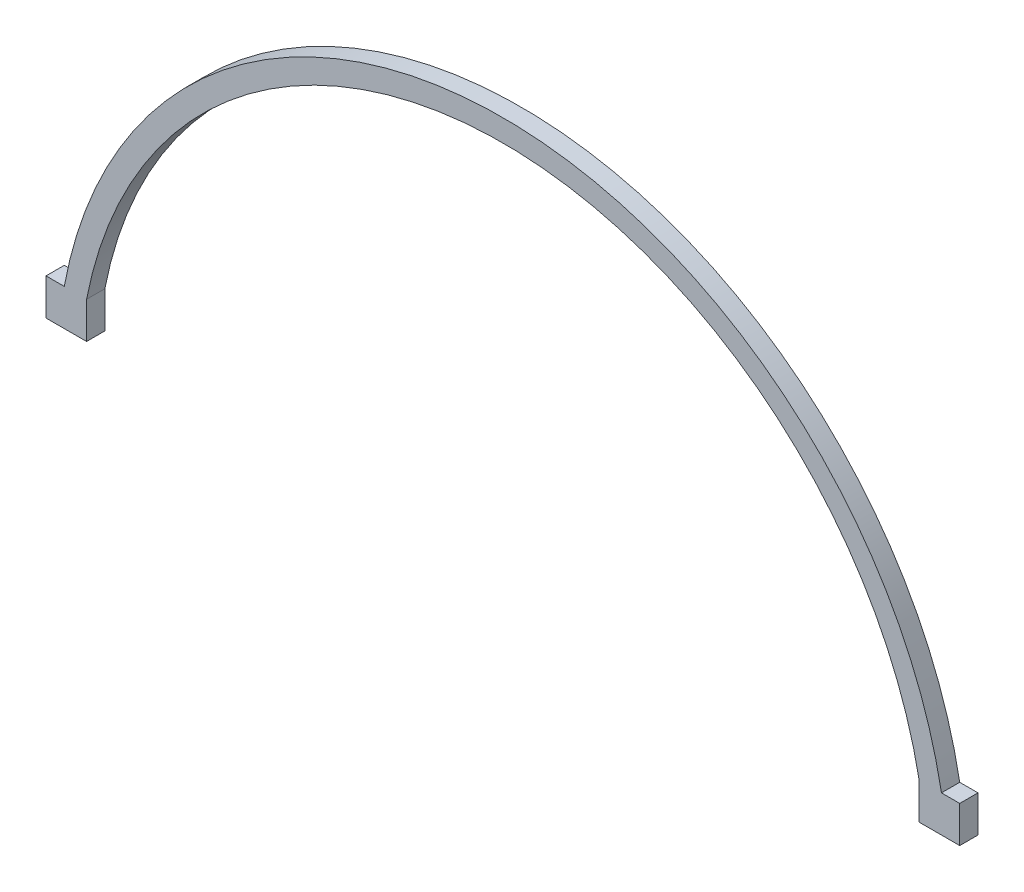
ISO-10303-21;
HEADER;
FILE_DESCRIPTION(('STEP AP214'),'2;1');
FILE_NAME('part.step','',(''),(''),'','','');
FILE_SCHEMA(('AUTOMOTIVE_DESIGN { 1 0 10303 214 1 1 1 1 }'));
ENDSEC;
DATA;
#1=APPLICATION_CONTEXT('core data for automotive mechanical design processes');
#2=APPLICATION_PROTOCOL_DEFINITION('international standard','automotive_design',2000,#1);
#3=PRODUCT_CONTEXT('',#1,'mechanical');
#4=PRODUCT('Part','Part','',(#3));
#5=PRODUCT_RELATED_PRODUCT_CATEGORY('part','',(#4));
#6=PRODUCT_DEFINITION_FORMATION('','',#4);
#7=PRODUCT_DEFINITION_CONTEXT('part definition',#1,'design');
#8=PRODUCT_DEFINITION('design','',#6,#7);
#9=PRODUCT_DEFINITION_SHAPE('','',#8);
#10=(LENGTH_UNIT() NAMED_UNIT(*) SI_UNIT(.MILLI.,.METRE.));
#11=(NAMED_UNIT(*) PLANE_ANGLE_UNIT() SI_UNIT($,.RADIAN.));
#12=(NAMED_UNIT(*) SI_UNIT($,.STERADIAN.) SOLID_ANGLE_UNIT());
#13=UNCERTAINTY_MEASURE_WITH_UNIT(LENGTH_MEASURE(1.E-05),#10,'distance_accuracy_value','');
#14=(GEOMETRIC_REPRESENTATION_CONTEXT(3) GLOBAL_UNCERTAINTY_ASSIGNED_CONTEXT((#13)) GLOBAL_UNIT_ASSIGNED_CONTEXT((#10,
#11,#12)) REPRESENTATION_CONTEXT('',''));
#15=CARTESIAN_POINT('',(0.,0.,0.));
#16=DIRECTION('',(0.,0.,1.));
#17=DIRECTION('',(1.,0.,0.));
#18=AXIS2_PLACEMENT_3D('',#15,#16,#17);
#19=CARTESIAN_POINT('',(0.,-13.97,3.175));
#20=DIRECTION('',(0.,0.,-1.));
#21=DIRECTION('',(-1.,0.,0.));
#22=AXIS2_PLACEMENT_3D('',#19,#20,#21);
#23=CYLINDRICAL_SURFACE('',#22,73.66);
#24=CARTESIAN_POINT('',(0.,-13.97,0.));
#25=DIRECTION('',(0.,0.,-1.));
#26=DIRECTION('',(-1.,0.,0.));
#27=AXIS2_PLACEMENT_3D('',#24,#25,#26);
#28=CIRCLE('',#27,73.66);
#29=CARTESIAN_POINT('',(-72.3231270065116,-3.63747305882006E-13,0.));
#30=VERTEX_POINT('',#29);
#31=CARTESIAN_POINT('',(72.3231270065116,0.,0.));
#32=VERTEX_POINT('',#31);
#33=EDGE_CURVE('E189',#30,#32,#28,.T.);
#34=ORIENTED_EDGE('',*,*,#33,.T.);
#35=DIRECTION('',(0.,0.,-1.));
#36=VECTOR('',#35,1.);
#37=CARTESIAN_POINT('',(72.3231270065116,0.,3.175));
#38=LINE('',#37,#36);
#39=CARTESIAN_POINT('',(72.3231270065116,3.63747305882006E-13,3.175));
#40=VERTEX_POINT('',#39);
#41=EDGE_CURVE('E48',#40,#32,#38,.T.);
#42=ORIENTED_EDGE('',*,*,#41,.F.);
#43=CARTESIAN_POINT('',(0.,-13.97,3.175));
#44=DIRECTION('',(0.,0.,-1.));
#45=DIRECTION('',(-1.,0.,0.));
#46=AXIS2_PLACEMENT_3D('',#43,#44,#45);
#47=CIRCLE('',#46,73.66);
#48=CARTESIAN_POINT('',(-72.3231270065116,0.,3.175));
#49=VERTEX_POINT('',#48);
#50=EDGE_CURVE('E190',#49,#40,#47,.T.);
#51=ORIENTED_EDGE('',*,*,#50,.F.);
#52=DIRECTION('',(0.,0.,-1.));
#53=VECTOR('',#52,1.);
#54=CARTESIAN_POINT('',(-72.3231270065116,0.,3.175));
#55=LINE('',#54,#53);
#56=EDGE_CURVE('E11',#49,#30,#55,.T.);
#57=ORIENTED_EDGE('',*,*,#56,.T.);
#58=EDGE_LOOP('',(#34,#42,#51,#57));
#59=FACE_BOUND('',#58,.T.);
#60=ADVANCED_FACE('F39',(#59),#23,.F.);
#61=CARTESIAN_POINT('',(0.,-13.97,3.175));
#62=DIRECTION('',(0.,0.,-1.));
#63=DIRECTION('',(-1.,0.,0.));
#64=AXIS2_PLACEMENT_3D('',#61,#62,#63);
#65=CYLINDRICAL_SURFACE('',#64,77.47);
#66=CARTESIAN_POINT('',(0.,-13.97,0.));
#67=DIRECTION('',(0.,0.,-1.));
#68=DIRECTION('',(-1.,0.,0.));
#69=AXIS2_PLACEMENT_3D('',#66,#67,#68);
#70=CIRCLE('',#69,77.47);
#71=CARTESIAN_POINT('',(-76.2,0.,0.));
#72=VERTEX_POINT('',#71);
#73=CARTESIAN_POINT('',(76.2,3.83245938822769E-13,0.));
#74=VERTEX_POINT('',#73);
#75=EDGE_CURVE('E194',#72,#74,#70,.T.);
#76=ORIENTED_EDGE('',*,*,#75,.F.);
#77=DIRECTION('',(0.,0.,-1.));
#78=VECTOR('',#77,1.);
#79=CARTESIAN_POINT('',(-76.2,0.,3.175));
#80=LINE('',#79,#78);
#81=CARTESIAN_POINT('',(-76.2,0.,3.175));
#82=VERTEX_POINT('',#81);
#83=EDGE_CURVE('E56',#82,#72,#80,.T.);
#84=ORIENTED_EDGE('',*,*,#83,.F.);
#85=CARTESIAN_POINT('',(0.,-13.97,3.175));
#86=DIRECTION('',(0.,0.,-1.));
#87=DIRECTION('',(-1.,0.,0.));
#88=AXIS2_PLACEMENT_3D('',#85,#86,#87);
#89=CIRCLE('',#88,77.47);
#90=CARTESIAN_POINT('',(76.2,3.83245938822769E-13,3.175));
#91=VERTEX_POINT('',#90);
#92=EDGE_CURVE('E193',#82,#91,#89,.T.);
#93=ORIENTED_EDGE('',*,*,#92,.T.);
#94=DIRECTION('',(0.,0.,-1.));
#95=VECTOR('',#94,1.);
#96=CARTESIAN_POINT('',(76.2,0.,3.175));
#97=LINE('',#96,#95);
#98=EDGE_CURVE('E205',#91,#74,#97,.T.);
#99=ORIENTED_EDGE('',*,*,#98,.T.);
#100=EDGE_LOOP('',(#76,#84,#93,#99));
#101=FACE_BOUND('',#100,.T.);
#102=ADVANCED_FACE('F208',(#101),#65,.T.);
#103=CARTESIAN_POINT('',(0.,-13.97,3.175));
#104=DIRECTION('',(0.,0.,-1.));
#105=DIRECTION('',(-1.,0.,0.));
#106=AXIS2_PLACEMENT_3D('',#103,#104,#105);
#107=PLANE('',#106);
#108=ORIENTED_EDGE('',*,*,#92,.F.);
#109=DIRECTION('',(-1.,0.,0.));
#110=VECTOR('',#109,1.);
#111=CARTESIAN_POINT('',(-72.3231270065116,-3.63747305882006E-13,3.175));
#112=LINE('',#111,#110);
#113=CARTESIAN_POINT('',(-79.375,-3.99214519607051E-13,3.175));
#114=VERTEX_POINT('',#113);
#115=EDGE_CURVE('E224',#82,#114,#112,.T.);
#116=ORIENTED_EDGE('',*,*,#115,.T.);
#117=DIRECTION('',(0.,1.,0.));
#118=VECTOR('',#117,1.);
#119=CARTESIAN_POINT('',(-79.375,-6.3500000000004,3.175));
#120=LINE('',#119,#118);
#121=CARTESIAN_POINT('',(-79.375,-6.3500000000004,3.175));
#122=VERTEX_POINT('',#121);
#123=EDGE_CURVE('E128',#122,#114,#120,.T.);
#124=ORIENTED_EDGE('',*,*,#123,.F.);
#125=DIRECTION('',(-1.,0.,0.));
#126=VECTOR('',#125,1.);
#127=CARTESIAN_POINT('',(-72.3231270065115,-6.35000000000036,3.175));
#128=LINE('',#127,#126);
#129=CARTESIAN_POINT('',(-72.3231270065115,-6.35000000000036,3.175));
#130=VERTEX_POINT('',#129);
#131=EDGE_CURVE('E120',#130,#122,#128,.T.);
#132=ORIENTED_EDGE('',*,*,#131,.F.);
#133=DIRECTION('',(0.,1.,0.));
#134=VECTOR('',#133,1.);
#135=CARTESIAN_POINT('',(-72.3231270065115,-6.35000000000036,3.175));
#136=LINE('',#135,#134);
#137=EDGE_CURVE('E125',#130,#49,#136,.T.);
#138=ORIENTED_EDGE('',*,*,#137,.T.);
#139=ORIENTED_EDGE('',*,*,#50,.T.);
#140=DIRECTION('',(0.,1.,0.));
#141=VECTOR('',#140,1.);
#142=CARTESIAN_POINT('',(72.3231270065116,-6.34999999999964,3.175));
#143=LINE('',#142,#141);
#144=CARTESIAN_POINT('',(72.3231270065116,-6.34999999999964,3.175));
#145=VERTEX_POINT('',#144);
#146=EDGE_CURVE('E169',#145,#40,#143,.T.);
#147=ORIENTED_EDGE('',*,*,#146,.F.);
#148=DIRECTION('',(-1.,0.,0.));
#149=VECTOR('',#148,1.);
#150=CARTESIAN_POINT('',(72.3231270065116,-6.34999999999964,3.175));
#151=LINE('',#150,#149);
#152=CARTESIAN_POINT('',(79.375,-6.3499999999996,3.175));
#153=VERTEX_POINT('',#152);
#154=EDGE_CURVE('E167',#153,#145,#151,.T.);
#155=ORIENTED_EDGE('',*,*,#154,.F.);
#156=DIRECTION('',(0.,1.,0.));
#157=VECTOR('',#156,1.);
#158=CARTESIAN_POINT('',(79.375,-6.3499999999996,3.175));
#159=LINE('',#158,#157);
#160=CARTESIAN_POINT('',(79.375,3.99214519607051E-13,3.175));
#161=VERTEX_POINT('',#160);
#162=EDGE_CURVE('E178',#153,#161,#159,.T.);
#163=ORIENTED_EDGE('',*,*,#162,.T.);
#164=DIRECTION('',(-1.,0.,0.));
#165=VECTOR('',#164,1.);
#166=CARTESIAN_POINT('',(72.3231270065116,3.63747305882006E-13,3.175));
#167=LINE('',#166,#165);
#168=EDGE_CURVE('E161',#161,#91,#167,.T.);
#169=ORIENTED_EDGE('',*,*,#168,.T.);
#170=EDGE_LOOP('',(#108,#116,#124,#132,#138,#139,#147,#155,#163,#169));
#171=FACE_BOUND('',#170,.T.);
#172=ADVANCED_FACE('F122',(#171),#107,.F.);
#173=CARTESIAN_POINT('',(0.,-13.97,0.));
#174=DIRECTION('',(0.,0.,-1.));
#175=DIRECTION('',(-1.,0.,0.));
#176=AXIS2_PLACEMENT_3D('',#173,#174,#175);
#177=PLANE('',#176);
#178=ORIENTED_EDGE('',*,*,#33,.F.);
#179=DIRECTION('',(0.,1.,0.));
#180=VECTOR('',#179,1.);
#181=CARTESIAN_POINT('',(-72.3231270065115,-6.35000000000036,0.));
#182=LINE('',#181,#180);
#183=CARTESIAN_POINT('',(-72.3231270065115,-6.35000000000036,0.));
#184=VERTEX_POINT('',#183);
#185=EDGE_CURVE('E228',#184,#30,#182,.T.);
#186=ORIENTED_EDGE('',*,*,#185,.F.);
#187=DIRECTION('',(1.,0.,0.));
#188=VECTOR('',#187,1.);
#189=CARTESIAN_POINT('',(-72.3231270065115,-6.35000000000036,0.));
#190=LINE('',#189,#188);
#191=CARTESIAN_POINT('',(-79.375,-6.3500000000004,0.));
#192=VERTEX_POINT('',#191);
#193=EDGE_CURVE('E138',#192,#184,#190,.T.);
#194=ORIENTED_EDGE('',*,*,#193,.F.);
#195=DIRECTION('',(0.,1.,0.));
#196=VECTOR('',#195,1.);
#197=CARTESIAN_POINT('',(-79.375,-6.3500000000004,0.));
#198=LINE('',#197,#196);
#199=CARTESIAN_POINT('',(-79.375,-3.99214519607051E-13,0.));
#200=VERTEX_POINT('',#199);
#201=EDGE_CURVE('E152',#192,#200,#198,.T.);
#202=ORIENTED_EDGE('',*,*,#201,.T.);
#203=DIRECTION('',(1.,0.,0.));
#204=VECTOR('',#203,1.);
#205=CARTESIAN_POINT('',(-72.3231270065116,-3.63747305882006E-13,0.));
#206=LINE('',#205,#204);
#207=EDGE_CURVE('E143',#200,#72,#206,.T.);
#208=ORIENTED_EDGE('',*,*,#207,.T.);
#209=ORIENTED_EDGE('',*,*,#75,.T.);
#210=DIRECTION('',(1.,0.,0.));
#211=VECTOR('',#210,1.);
#212=CARTESIAN_POINT('',(72.3231270065116,3.63747305882006E-13,0.));
#213=LINE('',#212,#211);
#214=CARTESIAN_POINT('',(79.375,3.99214519607051E-13,0.));
#215=VERTEX_POINT('',#214);
#216=EDGE_CURVE('E75',#74,#215,#213,.T.);
#217=ORIENTED_EDGE('',*,*,#216,.T.);
#218=DIRECTION('',(0.,1.,0.));
#219=VECTOR('',#218,1.);
#220=CARTESIAN_POINT('',(79.375,-6.3499999999996,0.));
#221=LINE('',#220,#219);
#222=CARTESIAN_POINT('',(79.375,-6.3499999999996,0.));
#223=VERTEX_POINT('',#222);
#224=EDGE_CURVE('E182',#223,#215,#221,.T.);
#225=ORIENTED_EDGE('',*,*,#224,.F.);
#226=DIRECTION('',(1.,0.,0.));
#227=VECTOR('',#226,1.);
#228=CARTESIAN_POINT('',(72.3231270065116,-6.34999999999964,0.));
#229=LINE('',#228,#227);
#230=CARTESIAN_POINT('',(72.3231270065116,-6.34999999999964,0.));
#231=VERTEX_POINT('',#230);
#232=EDGE_CURVE('E160',#231,#223,#229,.T.);
#233=ORIENTED_EDGE('',*,*,#232,.F.);
#234=DIRECTION('',(0.,1.,0.));
#235=VECTOR('',#234,1.);
#236=CARTESIAN_POINT('',(72.3231270065116,-6.34999999999964,0.));
#237=LINE('',#236,#235);
#238=EDGE_CURVE('E186',#231,#32,#237,.T.);
#239=ORIENTED_EDGE('',*,*,#238,.T.);
#240=EDGE_LOOP('',(#178,#186,#194,#202,#208,#209,#217,#225,#233,#239));
#241=FACE_BOUND('',#240,.T.);
#242=ADVANCED_FACE('F213',(#241),#177,.T.);
#243=CARTESIAN_POINT('',(72.3231270065116,-6.34999999999964,0.));
#244=DIRECTION('',(1.,0.,0.));
#245=DIRECTION('',(0.,1.,0.));
#246=AXIS2_PLACEMENT_3D('',#243,#244,#245);
#247=PLANE('',#246);
#248=ORIENTED_EDGE('',*,*,#41,.T.);
#249=ORIENTED_EDGE('',*,*,#238,.F.);
#250=DIRECTION('',(0.,0.,-1.));
#251=VECTOR('',#250,1.);
#252=CARTESIAN_POINT('',(72.3231270065116,-6.34999999999964,0.));
#253=LINE('',#252,#251);
#254=EDGE_CURVE('E156',#145,#231,#253,.T.);
#255=ORIENTED_EDGE('',*,*,#254,.F.);
#256=ORIENTED_EDGE('',*,*,#146,.T.);
#257=EDGE_LOOP('',(#248,#249,#255,#256));
#258=FACE_BOUND('',#257,.T.);
#259=ADVANCED_FACE('F253',(#258),#247,.F.);
#260=CARTESIAN_POINT('',(79.375,-6.3499999999996,0.));
#261=DIRECTION('',(-1.,0.,0.));
#262=DIRECTION('',(0.,-1.,0.));
#263=AXIS2_PLACEMENT_3D('',#260,#261,#262);
#264=PLANE('',#263);
#265=DIRECTION('',(0.,0.,1.));
#266=VECTOR('',#265,1.);
#267=CARTESIAN_POINT('',(79.375,3.99214519607051E-13,0.));
#268=LINE('',#267,#266);
#269=EDGE_CURVE('E150',#215,#161,#268,.T.);
#270=ORIENTED_EDGE('',*,*,#269,.T.);
#271=ORIENTED_EDGE('',*,*,#162,.F.);
#272=DIRECTION('',(0.,0.,1.));
#273=VECTOR('',#272,1.);
#274=CARTESIAN_POINT('',(79.375,-6.3499999999996,0.));
#275=LINE('',#274,#273);
#276=EDGE_CURVE('E164',#223,#153,#275,.T.);
#277=ORIENTED_EDGE('',*,*,#276,.F.);
#278=ORIENTED_EDGE('',*,*,#224,.T.);
#279=EDGE_LOOP('',(#270,#271,#277,#278));
#280=FACE_BOUND('',#279,.T.);
#281=ADVANCED_FACE('F262',(#280),#264,.F.);
#282=CARTESIAN_POINT('',(0.,-6.35,0.));
#283=DIRECTION('',(0.,1.,0.));
#284=DIRECTION('',(-1.,0.,0.));
#285=AXIS2_PLACEMENT_3D('',#282,#283,#284);
#286=PLANE('',#285);
#287=ORIENTED_EDGE('',*,*,#254,.T.);
#288=ORIENTED_EDGE('',*,*,#232,.T.);
#289=ORIENTED_EDGE('',*,*,#276,.T.);
#290=ORIENTED_EDGE('',*,*,#154,.T.);
#291=EDGE_LOOP('',(#287,#288,#289,#290));
#292=FACE_BOUND('',#291,.T.);
#293=ADVANCED_FACE('F256',(#292),#286,.F.);
#294=CARTESIAN_POINT('',(0.,0.,0.));
#295=DIRECTION('',(0.,1.,0.));
#296=DIRECTION('',(-1.,0.,0.));
#297=AXIS2_PLACEMENT_3D('',#294,#295,#296);
#298=PLANE('',#297);
#299=ORIENTED_EDGE('',*,*,#216,.F.);
#300=ORIENTED_EDGE('',*,*,#98,.F.);
#301=ORIENTED_EDGE('',*,*,#168,.F.);
#302=ORIENTED_EDGE('',*,*,#269,.F.);
#303=EDGE_LOOP('',(#299,#300,#301,#302));
#304=FACE_BOUND('',#303,.T.);
#305=ADVANCED_FACE('F261',(#304),#298,.T.);
#306=CARTESIAN_POINT('',(-72.3231270065115,-6.35000000000036,0.));
#307=DIRECTION('',(-1.,0.,0.));
#308=DIRECTION('',(0.,-1.,0.));
#309=AXIS2_PLACEMENT_3D('',#306,#307,#308);
#310=PLANE('',#309);
#311=ORIENTED_EDGE('',*,*,#56,.F.);
#312=ORIENTED_EDGE('',*,*,#137,.F.);
#313=DIRECTION('',(0.,0.,1.));
#314=VECTOR('',#313,1.);
#315=CARTESIAN_POINT('',(-72.3231270065115,-6.35000000000036,0.));
#316=LINE('',#315,#314);
#317=EDGE_CURVE('E133',#184,#130,#316,.T.);
#318=ORIENTED_EDGE('',*,*,#317,.F.);
#319=ORIENTED_EDGE('',*,*,#185,.T.);
#320=EDGE_LOOP('',(#311,#312,#318,#319));
#321=FACE_BOUND('',#320,.T.);
#322=ADVANCED_FACE('F145',(#321),#310,.F.);
#323=CARTESIAN_POINT('',(-79.375,-6.3500000000004,0.));
#324=DIRECTION('',(1.,0.,0.));
#325=DIRECTION('',(0.,1.,0.));
#326=AXIS2_PLACEMENT_3D('',#323,#324,#325);
#327=PLANE('',#326);
#328=DIRECTION('',(0.,0.,-1.));
#329=VECTOR('',#328,1.);
#330=CARTESIAN_POINT('',(-79.375,-3.99214519607051E-13,0.));
#331=LINE('',#330,#329);
#332=EDGE_CURVE('E221',#114,#200,#331,.T.);
#333=ORIENTED_EDGE('',*,*,#332,.T.);
#334=ORIENTED_EDGE('',*,*,#201,.F.);
#335=DIRECTION('',(0.,0.,-1.));
#336=VECTOR('',#335,1.);
#337=CARTESIAN_POINT('',(-79.375,-6.3500000000004,0.));
#338=LINE('',#337,#336);
#339=EDGE_CURVE('E132',#122,#192,#338,.T.);
#340=ORIENTED_EDGE('',*,*,#339,.F.);
#341=ORIENTED_EDGE('',*,*,#123,.T.);
#342=EDGE_LOOP('',(#333,#334,#340,#341));
#343=FACE_BOUND('',#342,.T.);
#344=ADVANCED_FACE('F238',(#343),#327,.F.);
#345=CARTESIAN_POINT('',(0.,-6.35,0.));
#346=DIRECTION('',(0.,-1.,0.));
#347=DIRECTION('',(1.,0.,0.));
#348=AXIS2_PLACEMENT_3D('',#345,#346,#347);
#349=PLANE('',#348);
#350=ORIENTED_EDGE('',*,*,#317,.T.);
#351=ORIENTED_EDGE('',*,*,#131,.T.);
#352=ORIENTED_EDGE('',*,*,#339,.T.);
#353=ORIENTED_EDGE('',*,*,#193,.T.);
#354=EDGE_LOOP('',(#350,#351,#352,#353));
#355=FACE_BOUND('',#354,.T.);
#356=ADVANCED_FACE('F136',(#355),#349,.T.);
#357=CARTESIAN_POINT('',(0.,0.,0.));
#358=DIRECTION('',(0.,-1.,0.));
#359=DIRECTION('',(1.,0.,0.));
#360=AXIS2_PLACEMENT_3D('',#357,#358,#359);
#361=PLANE('',#360);
#362=ORIENTED_EDGE('',*,*,#83,.T.);
#363=ORIENTED_EDGE('',*,*,#207,.F.);
#364=ORIENTED_EDGE('',*,*,#332,.F.);
#365=ORIENTED_EDGE('',*,*,#115,.F.);
#366=EDGE_LOOP('',(#362,#363,#364,#365));
#367=FACE_BOUND('',#366,.T.);
#368=ADVANCED_FACE('F239',(#367),#361,.F.);
#369=CLOSED_SHELL('',(#60,#102,#172,#242,#259,#281,#293,#305,#322,#344,#356,#368));
#370=MANIFOLD_SOLID_BREP('B2',#369);
#371=ADVANCED_BREP_SHAPE_REPRESENTATION('',(#18,#370),#14);
#372=SHAPE_DEFINITION_REPRESENTATION(#9,#371);
ENDSEC;
END-ISO-10303-21;
